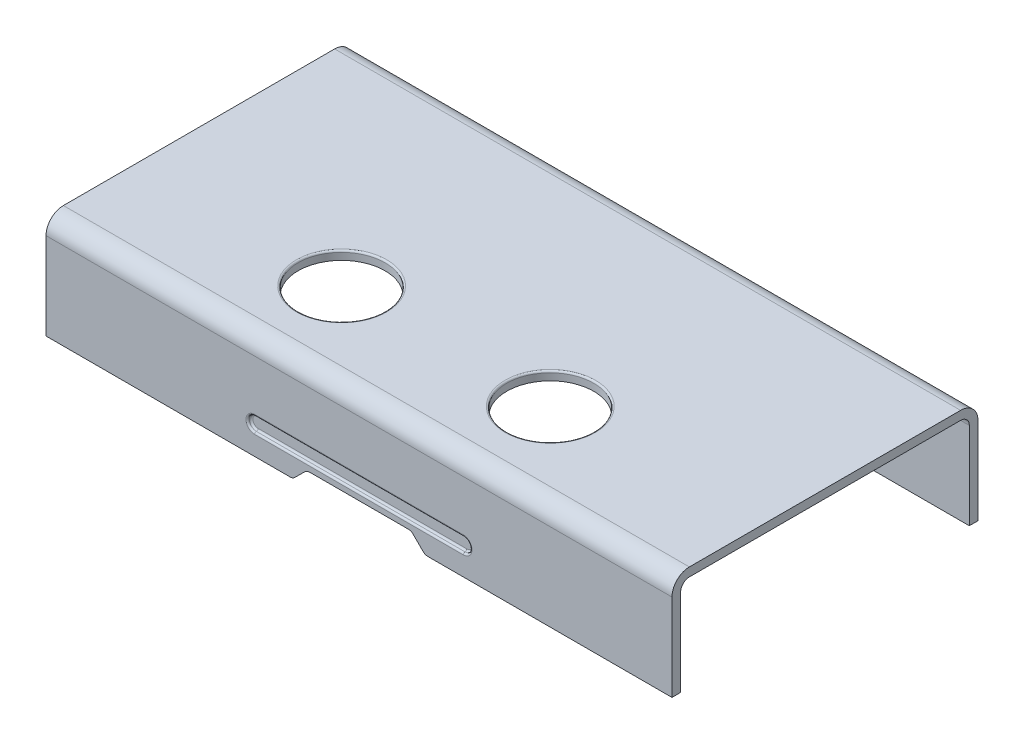
ISO-10303-21;
HEADER;
FILE_DESCRIPTION(('STEP AP214'),'2;1');
FILE_NAME('part.step','',(''),(''),'','','');
FILE_SCHEMA(('AUTOMOTIVE_DESIGN { 1 0 10303 214 1 1 1 1 }'));
ENDSEC;
DATA;
#1=APPLICATION_CONTEXT('core data for automotive mechanical design processes');
#2=APPLICATION_PROTOCOL_DEFINITION('international standard','automotive_design',2000,#1);
#3=PRODUCT_CONTEXT('',#1,'mechanical');
#4=PRODUCT('Part','Part','',(#3));
#5=PRODUCT_RELATED_PRODUCT_CATEGORY('part','',(#4));
#6=PRODUCT_DEFINITION_FORMATION('','',#4);
#7=PRODUCT_DEFINITION_CONTEXT('part definition',#1,'design');
#8=PRODUCT_DEFINITION('design','',#6,#7);
#9=PRODUCT_DEFINITION_SHAPE('','',#8);
#10=(LENGTH_UNIT() NAMED_UNIT(*) SI_UNIT(.MILLI.,.METRE.));
#11=(NAMED_UNIT(*) PLANE_ANGLE_UNIT() SI_UNIT($,.RADIAN.));
#12=(NAMED_UNIT(*) SI_UNIT($,.STERADIAN.) SOLID_ANGLE_UNIT());
#13=UNCERTAINTY_MEASURE_WITH_UNIT(LENGTH_MEASURE(1.E-05),#10,'distance_accuracy_value','');
#14=(GEOMETRIC_REPRESENTATION_CONTEXT(3) GLOBAL_UNCERTAINTY_ASSIGNED_CONTEXT((#13)) GLOBAL_UNIT_ASSIGNED_CONTEXT((#10,
#11,#12)) REPRESENTATION_CONTEXT('',''));
#15=CARTESIAN_POINT('',(0.,0.,0.));
#16=DIRECTION('',(0.,0.,1.));
#17=DIRECTION('',(1.,0.,0.));
#18=AXIS2_PLACEMENT_3D('',#15,#16,#17);
#19=CARTESIAN_POINT('',(0.,0.,0.));
#20=DIRECTION('',(0.,1.,0.));
#21=DIRECTION('',(0.,0.,1.));
#22=AXIS2_PLACEMENT_3D('',#19,#20,#21);
#23=PLANE('',#22);
#24=DIRECTION('',(1.,0.,0.));
#25=VECTOR('',#24,1.);
#26=CARTESIAN_POINT('',(0.,0.,4.15));
#27=LINE('',#26,#25);
#28=CARTESIAN_POINT('',(-9.,0.,4.15));
#29=VERTEX_POINT('',#28);
#30=CARTESIAN_POINT('',(-1.98284271247461,0.,4.15));
#31=VERTEX_POINT('',#30);
#32=EDGE_CURVE('E229',#29,#31,#27,.T.);
#33=ORIENTED_EDGE('',*,*,#32,.T.);
#34=DIRECTION('',(0.,0.,-1.));
#35=VECTOR('',#34,1.);
#36=CARTESIAN_POINT('',(-1.98284271247461,0.,0.));
#37=LINE('',#36,#35);
#38=CARTESIAN_POINT('',(-1.98284271247461,0.,4.4));
#39=VERTEX_POINT('',#38);
#40=EDGE_CURVE('E409',#31,#39,#37,.F.);
#41=ORIENTED_EDGE('',*,*,#40,.T.);
#42=DIRECTION('',(1.,0.,0.));
#43=VECTOR('',#42,1.);
#44=CARTESIAN_POINT('',(-9.,0.,4.4));
#45=LINE('',#44,#43);
#46=CARTESIAN_POINT('',(-9.,0.,4.4));
#47=VERTEX_POINT('',#46);
#48=EDGE_CURVE('E276',#47,#39,#45,.T.);
#49=ORIENTED_EDGE('',*,*,#48,.F.);
#50=DIRECTION('',(0.,0.,1.));
#51=VECTOR('',#50,1.);
#52=CARTESIAN_POINT('',(-9.,0.,-4.4));
#53=LINE('',#52,#51);
#54=EDGE_CURVE('E264',#29,#47,#53,.T.);
#55=ORIENTED_EDGE('',*,*,#54,.F.);
#56=EDGE_LOOP('',(#33,#41,#49,#55));
#57=FACE_BOUND('',#56,.T.);
#58=ADVANCED_FACE('F33',(#57),#23,.F.);
#59=DIRECTION('',(0.,0.,-1.));
#60=VECTOR('',#59,1.);
#61=CARTESIAN_POINT('',(9.,0.,-4.4));
#62=LINE('',#61,#60);
#63=CARTESIAN_POINT('',(9.,0.,-4.15));
#64=VERTEX_POINT('',#63);
#65=CARTESIAN_POINT('',(9.,0.,-4.4));
#66=VERTEX_POINT('',#65);
#67=EDGE_CURVE('E279',#64,#66,#62,.T.);
#68=ORIENTED_EDGE('',*,*,#67,.F.);
#69=DIRECTION('',(-1.,0.,0.));
#70=VECTOR('',#69,1.);
#71=CARTESIAN_POINT('',(0.,0.,-4.15));
#72=LINE('',#71,#70);
#73=CARTESIAN_POINT('',(-9.,0.,-4.15));
#74=VERTEX_POINT('',#73);
#75=EDGE_CURVE('E317',#64,#74,#72,.T.);
#76=ORIENTED_EDGE('',*,*,#75,.T.);
#77=CARTESIAN_POINT('',(-9.,0.,-4.4));
#78=VERTEX_POINT('',#77);
#79=EDGE_CURVE('E273',#78,#74,#53,.T.);
#80=ORIENTED_EDGE('',*,*,#79,.F.);
#81=DIRECTION('',(-1.,0.,0.));
#82=VECTOR('',#81,1.);
#83=CARTESIAN_POINT('',(-9.,0.,-4.4));
#84=LINE('',#83,#82);
#85=EDGE_CURVE('E269',#66,#78,#84,.T.);
#86=ORIENTED_EDGE('',*,*,#85,.F.);
#87=EDGE_LOOP('',(#68,#76,#80,#86));
#88=FACE_BOUND('',#87,.T.);
#89=ADVANCED_FACE('F508',(#88),#23,.F.);
#90=CARTESIAN_POINT('',(-9.,3.,-4.4));
#91=DIRECTION('',(1.,0.,0.));
#92=DIRECTION('',(0.,0.,-1.));
#93=AXIS2_PLACEMENT_3D('',#90,#91,#92);
#94=PLANE('',#93);
#95=ORIENTED_EDGE('',*,*,#79,.T.);
#96=DIRECTION('',(0.,-1.,0.));
#97=VECTOR('',#96,1.);
#98=CARTESIAN_POINT('',(-9.,0.25,-4.15));
#99=LINE('',#98,#97);
#100=CARTESIAN_POINT('',(-9.,2.5,-4.15));
#101=VERTEX_POINT('',#100);
#102=EDGE_CURVE('E222',#101,#74,#99,.T.);
#103=ORIENTED_EDGE('',*,*,#102,.F.);
#104=CARTESIAN_POINT('',(-9.,2.5,-3.9));
#105=DIRECTION('',(-1.,0.,0.));
#106=DIRECTION('',(0.,0.,1.));
#107=AXIS2_PLACEMENT_3D('',#104,#105,#106);
#108=CIRCLE('',#107,0.25);
#109=CARTESIAN_POINT('',(-9.,2.75,-3.9));
#110=VERTEX_POINT('',#109);
#111=EDGE_CURVE('E240',#110,#101,#108,.T.);
#112=ORIENTED_EDGE('',*,*,#111,.F.);
#113=DIRECTION('',(0.,0.,-1.));
#114=VECTOR('',#113,1.);
#115=CARTESIAN_POINT('',(-9.,2.75,3.9));
#116=LINE('',#115,#114);
#117=CARTESIAN_POINT('',(-9.,2.75,3.9));
#118=VERTEX_POINT('',#117);
#119=EDGE_CURVE('E238',#118,#110,#116,.T.);
#120=ORIENTED_EDGE('',*,*,#119,.F.);
#121=CARTESIAN_POINT('',(-9.,2.5,3.9));
#122=DIRECTION('',(-1.,0.,0.));
#123=DIRECTION('',(0.,0.,1.));
#124=AXIS2_PLACEMENT_3D('',#121,#122,#123);
#125=CIRCLE('',#124,0.25);
#126=CARTESIAN_POINT('',(-9.,2.5,4.15));
#127=VERTEX_POINT('',#126);
#128=EDGE_CURVE('E214',#127,#118,#125,.T.);
#129=ORIENTED_EDGE('',*,*,#128,.F.);
#130=DIRECTION('',(0.,1.,0.));
#131=VECTOR('',#130,1.);
#132=CARTESIAN_POINT('',(-9.,0.25,4.15));
#133=LINE('',#132,#131);
#134=EDGE_CURVE('E225',#29,#127,#133,.T.);
#135=ORIENTED_EDGE('',*,*,#134,.F.);
#136=ORIENTED_EDGE('',*,*,#54,.T.);
#137=DIRECTION('',(0.,-1.,0.));
#138=VECTOR('',#137,1.);
#139=CARTESIAN_POINT('',(-9.,3.,4.4));
#140=LINE('',#139,#138);
#141=CARTESIAN_POINT('',(-9.,2.5,4.4));
#142=VERTEX_POINT('',#141);
#143=EDGE_CURVE('E292',#142,#47,#140,.T.);
#144=ORIENTED_EDGE('',*,*,#143,.F.);
#145=CARTESIAN_POINT('',(-9.,2.5,3.9));
#146=DIRECTION('',(1.,0.,0.));
#147=DIRECTION('',(0.,0.,-1.));
#148=AXIS2_PLACEMENT_3D('',#145,#146,#147);
#149=CIRCLE('',#148,0.5);
#150=CARTESIAN_POINT('',(-9.,3.,3.9));
#151=VERTEX_POINT('',#150);
#152=EDGE_CURVE('E309',#142,#151,#149,.F.);
#153=ORIENTED_EDGE('',*,*,#152,.T.);
#154=DIRECTION('',(0.,0.,1.));
#155=VECTOR('',#154,1.);
#156=CARTESIAN_POINT('',(-9.,3.,-4.4));
#157=LINE('',#156,#155);
#158=CARTESIAN_POINT('',(-9.,3.,-3.9));
#159=VERTEX_POINT('',#158);
#160=EDGE_CURVE('E265',#159,#151,#157,.T.);
#161=ORIENTED_EDGE('',*,*,#160,.F.);
#162=CARTESIAN_POINT('',(-9.,2.5,-3.9));
#163=DIRECTION('',(1.,0.,0.));
#164=DIRECTION('',(0.,0.,-1.));
#165=AXIS2_PLACEMENT_3D('',#162,#163,#164);
#166=CIRCLE('',#165,0.5);
#167=CARTESIAN_POINT('',(-9.,2.5,-4.4));
#168=VERTEX_POINT('',#167);
#169=EDGE_CURVE('E307',#159,#168,#166,.F.);
#170=ORIENTED_EDGE('',*,*,#169,.T.);
#171=DIRECTION('',(0.,-1.,0.));
#172=VECTOR('',#171,1.);
#173=CARTESIAN_POINT('',(-9.,3.,-4.4));
#174=LINE('',#173,#172);
#175=EDGE_CURVE('E272',#168,#78,#174,.T.);
#176=ORIENTED_EDGE('',*,*,#175,.T.);
#177=EDGE_LOOP('',(#95,#103,#112,#120,#129,#135,#136,#144,#153,#161,#170,#176));
#178=FACE_BOUND('',#177,.T.);
#179=ADVANCED_FACE('F235',(#178),#94,.F.);
#180=CARTESIAN_POINT('',(-9.,3.,4.4));
#181=DIRECTION('',(0.,0.,-1.));
#182=DIRECTION('',(-1.,0.,0.));
#183=AXIS2_PLACEMENT_3D('',#180,#181,#182);
#184=PLANE('',#183);
#185=DIRECTION('',(-1.,0.,0.));
#186=VECTOR('',#185,1.);
#187=CARTESIAN_POINT('',(-9.,1.05,4.4));
#188=LINE('',#187,#186);
#189=CARTESIAN_POINT('',(-3.,1.05,4.4));
#190=VERTEX_POINT('',#189);
#191=CARTESIAN_POINT('',(3.,1.05,4.4));
#192=VERTEX_POINT('',#191);
#193=EDGE_CURVE('E338',#190,#192,#188,.F.);
#194=ORIENTED_EDGE('',*,*,#193,.T.);
#195=CARTESIAN_POINT('',(3.,0.8,4.4));
#196=DIRECTION('',(0.,0.,-1.));
#197=DIRECTION('',(-1.,0.,0.));
#198=AXIS2_PLACEMENT_3D('',#195,#196,#197);
#199=CIRCLE('',#198,0.25);
#200=CARTESIAN_POINT('',(3.,0.55,4.4));
#201=VERTEX_POINT('',#200);
#202=EDGE_CURVE('E344',#192,#201,#199,.T.);
#203=ORIENTED_EDGE('',*,*,#202,.T.);
#204=DIRECTION('',(1.,0.,0.));
#205=VECTOR('',#204,1.);
#206=CARTESIAN_POINT('',(-9.,0.55,4.4));
#207=LINE('',#206,#205);
#208=CARTESIAN_POINT('',(-3.,0.55,4.4));
#209=VERTEX_POINT('',#208);
#210=EDGE_CURVE('E342',#201,#209,#207,.F.);
#211=ORIENTED_EDGE('',*,*,#210,.T.);
#212=CARTESIAN_POINT('',(-3.,0.8,4.4));
#213=DIRECTION('',(0.,0.,-1.));
#214=DIRECTION('',(-1.,0.,0.));
#215=AXIS2_PLACEMENT_3D('',#212,#213,#214);
#216=CIRCLE('',#215,0.25);
#217=EDGE_CURVE('E340',#209,#190,#216,.T.);
#218=ORIENTED_EDGE('',*,*,#217,.T.);
#219=EDGE_LOOP('',(#194,#203,#211,#218));
#220=FACE_BOUND('',#219,.T.);
#221=DIRECTION('',(-0.707106781186551,0.707106781186544,0.));
#222=VECTOR('',#221,1.);
#223=CARTESIAN_POINT('',(-5.05000000000006,6.94999999999998,4.4));
#224=LINE('',#223,#222);
#225=CARTESIAN_POINT('',(1.55857864376268,0.34142135623731,4.4));
#226=VERTEX_POINT('',#225);
#227=CARTESIAN_POINT('',(1.84142135623731,0.0585786437626891,4.4));
#228=VERTEX_POINT('',#227);
#229=EDGE_CURVE('E327',#226,#228,#224,.F.);
#230=ORIENTED_EDGE('',*,*,#229,.T.);
#231=CARTESIAN_POINT('',(1.98284271247461,0.2,4.4));
#232=DIRECTION('',(0.,0.,-1.));
#233=DIRECTION('',(-1.,0.,0.));
#234=AXIS2_PLACEMENT_3D('',#231,#232,#233);
#235=CIRCLE('',#234,0.2);
#236=CARTESIAN_POINT('',(1.98284271247461,0.,4.4));
#237=VERTEX_POINT('',#236);
#238=EDGE_CURVE('E402',#228,#237,#235,.F.);
#239=ORIENTED_EDGE('',*,*,#238,.T.);
#240=CARTESIAN_POINT('',(9.,0.,4.4));
#241=VERTEX_POINT('',#240);
#242=EDGE_CURVE('E275',#237,#241,#45,.T.);
#243=ORIENTED_EDGE('',*,*,#242,.T.);
#244=DIRECTION('',(0.,-1.,0.));
#245=VECTOR('',#244,1.);
#246=CARTESIAN_POINT('',(9.,3.,4.4));
#247=LINE('',#246,#245);
#248=CARTESIAN_POINT('',(9.,2.5,4.4));
#249=VERTEX_POINT('',#248);
#250=EDGE_CURVE('E289',#249,#241,#247,.T.);
#251=ORIENTED_EDGE('',*,*,#250,.F.);
#252=DIRECTION('',(1.,0.,0.));
#253=VECTOR('',#252,1.);
#254=CARTESIAN_POINT('',(-9.,2.5,4.4));
#255=LINE('',#254,#253);
#256=EDGE_CURVE('E305',#249,#142,#255,.F.);
#257=ORIENTED_EDGE('',*,*,#256,.T.);
#258=ORIENTED_EDGE('',*,*,#143,.T.);
#259=ORIENTED_EDGE('',*,*,#48,.T.);
#260=CARTESIAN_POINT('',(-1.98284271247461,0.2,4.4));
#261=DIRECTION('',(0.,0.,-1.));
#262=DIRECTION('',(-1.,0.,0.));
#263=AXIS2_PLACEMENT_3D('',#260,#261,#262);
#264=CIRCLE('',#263,0.2);
#265=CARTESIAN_POINT('',(-1.8414213562373,0.0585786437626917,4.4));
#266=VERTEX_POINT('',#265);
#267=EDGE_CURVE('E400',#39,#266,#264,.F.);
#268=ORIENTED_EDGE('',*,*,#267,.T.);
#269=DIRECTION('',(-0.707106781186544,-0.707106781186551,0.));
#270=VECTOR('',#269,1.);
#271=CARTESIAN_POINT('',(-3.94999999999996,-2.04999999999999,4.4));
#272=LINE('',#271,#270);
#273=CARTESIAN_POINT('',(-1.55857864376269,0.341421356237309,4.4));
#274=VERTEX_POINT('',#273);
#275=EDGE_CURVE('E333',#266,#274,#272,.F.);
#276=ORIENTED_EDGE('',*,*,#275,.T.);
#277=CARTESIAN_POINT('',(-1.41715728752538,0.2,4.4));
#278=DIRECTION('',(0.,0.,-1.));
#279=DIRECTION('',(-1.,0.,0.));
#280=AXIS2_PLACEMENT_3D('',#277,#278,#279);
#281=CIRCLE('',#280,0.2);
#282=CARTESIAN_POINT('',(-1.41715728752538,0.4,4.4));
#283=VERTEX_POINT('',#282);
#284=EDGE_CURVE('E48',#274,#283,#281,.T.);
#285=ORIENTED_EDGE('',*,*,#284,.T.);
#286=DIRECTION('',(-1.,0.,0.));
#287=VECTOR('',#286,1.);
#288=CARTESIAN_POINT('',(-2.,0.4,4.4));
#289=LINE('',#288,#287);
#290=CARTESIAN_POINT('',(1.41715728752537,0.4,4.4));
#291=VERTEX_POINT('',#290);
#292=EDGE_CURVE('E232',#291,#283,#289,.T.);
#293=ORIENTED_EDGE('',*,*,#292,.F.);
#294=CARTESIAN_POINT('',(1.41715728752537,0.2,4.4));
#295=DIRECTION('',(0.,0.,-1.));
#296=DIRECTION('',(-1.,0.,0.));
#297=AXIS2_PLACEMENT_3D('',#294,#295,#296);
#298=CIRCLE('',#297,0.2);
#299=EDGE_CURVE('E56',#291,#226,#298,.T.);
#300=ORIENTED_EDGE('',*,*,#299,.T.);
#301=EDGE_LOOP('',(#230,#239,#243,#251,#257,#258,#259,#268,#276,#285,#293,#300));
#302=FACE_BOUND('',#301,.T.);
#303=ADVANCED_FACE('F469',(#220,#302),#184,.F.);
#304=CARTESIAN_POINT('',(9.,3.,-4.4));
#305=DIRECTION('',(-1.,0.,0.));
#306=DIRECTION('',(0.,0.,1.));
#307=AXIS2_PLACEMENT_3D('',#304,#305,#306);
#308=PLANE('',#307);
#309=CARTESIAN_POINT('',(9.,2.5,-3.9));
#310=DIRECTION('',(-1.,0.,0.));
#311=DIRECTION('',(0.,0.,1.));
#312=AXIS2_PLACEMENT_3D('',#309,#310,#311);
#313=CIRCLE('',#312,0.25);
#314=CARTESIAN_POINT('',(9.,2.75,-3.9));
#315=VERTEX_POINT('',#314);
#316=CARTESIAN_POINT('',(9.,2.5,-4.15));
#317=VERTEX_POINT('',#316);
#318=EDGE_CURVE('E321',#315,#317,#313,.T.);
#319=ORIENTED_EDGE('',*,*,#318,.T.);
#320=DIRECTION('',(0.,-1.,0.));
#321=VECTOR('',#320,1.);
#322=CARTESIAN_POINT('',(9.,3.,-4.15));
#323=LINE('',#322,#321);
#324=EDGE_CURVE('E261',#317,#64,#323,.T.);
#325=ORIENTED_EDGE('',*,*,#324,.T.);
#326=ORIENTED_EDGE('',*,*,#67,.T.);
#327=DIRECTION('',(0.,-1.,0.));
#328=VECTOR('',#327,1.);
#329=CARTESIAN_POINT('',(9.,3.,-4.4));
#330=LINE('',#329,#328);
#331=CARTESIAN_POINT('',(9.,2.5,-4.4));
#332=VERTEX_POINT('',#331);
#333=EDGE_CURVE('E286',#332,#66,#330,.T.);
#334=ORIENTED_EDGE('',*,*,#333,.F.);
#335=CARTESIAN_POINT('',(9.,2.5,-3.9));
#336=DIRECTION('',(-1.,0.,0.));
#337=DIRECTION('',(0.,0.,1.));
#338=AXIS2_PLACEMENT_3D('',#335,#336,#337);
#339=CIRCLE('',#338,0.5);
#340=CARTESIAN_POINT('',(9.,3.,-3.9));
#341=VERTEX_POINT('',#340);
#342=EDGE_CURVE('E301',#332,#341,#339,.F.);
#343=ORIENTED_EDGE('',*,*,#342,.T.);
#344=DIRECTION('',(0.,0.,-1.));
#345=VECTOR('',#344,1.);
#346=CARTESIAN_POINT('',(9.,3.,-4.4));
#347=LINE('',#346,#345);
#348=CARTESIAN_POINT('',(9.,3.,3.9));
#349=VERTEX_POINT('',#348);
#350=EDGE_CURVE('E268',#349,#341,#347,.T.);
#351=ORIENTED_EDGE('',*,*,#350,.F.);
#352=CARTESIAN_POINT('',(9.,2.5,3.9));
#353=DIRECTION('',(-1.,0.,0.));
#354=DIRECTION('',(0.,0.,1.));
#355=AXIS2_PLACEMENT_3D('',#352,#353,#354);
#356=CIRCLE('',#355,0.5);
#357=EDGE_CURVE('E303',#349,#249,#356,.F.);
#358=ORIENTED_EDGE('',*,*,#357,.T.);
#359=ORIENTED_EDGE('',*,*,#250,.T.);
#360=CARTESIAN_POINT('',(9.,0.,4.15));
#361=VERTEX_POINT('',#360);
#362=EDGE_CURVE('E280',#241,#361,#62,.T.);
#363=ORIENTED_EDGE('',*,*,#362,.T.);
#364=DIRECTION('',(0.,1.,0.));
#365=VECTOR('',#364,1.);
#366=CARTESIAN_POINT('',(9.,3.,4.15));
#367=LINE('',#366,#365);
#368=CARTESIAN_POINT('',(9.,2.5,4.15));
#369=VERTEX_POINT('',#368);
#370=EDGE_CURVE('E259',#361,#369,#367,.T.);
#371=ORIENTED_EDGE('',*,*,#370,.T.);
#372=CARTESIAN_POINT('',(9.,2.5,3.9));
#373=DIRECTION('',(-1.,0.,0.));
#374=DIRECTION('',(0.,0.,1.));
#375=AXIS2_PLACEMENT_3D('',#372,#373,#374);
#376=CIRCLE('',#375,0.25);
#377=CARTESIAN_POINT('',(9.,2.75,3.9));
#378=VERTEX_POINT('',#377);
#379=EDGE_CURVE('E217',#369,#378,#376,.T.);
#380=ORIENTED_EDGE('',*,*,#379,.T.);
#381=DIRECTION('',(0.,0.,-1.));
#382=VECTOR('',#381,1.);
#383=CARTESIAN_POINT('',(9.,2.75,-4.4));
#384=LINE('',#383,#382);
#385=EDGE_CURVE('E256',#378,#315,#384,.T.);
#386=ORIENTED_EDGE('',*,*,#385,.T.);
#387=EDGE_LOOP('',(#319,#325,#326,#334,#343,#351,#358,#359,#363,#371,#380,#386));
#388=FACE_BOUND('',#387,.T.);
#389=ADVANCED_FACE('F455',(#388),#308,.F.);
#390=CARTESIAN_POINT('',(-9.,3.,-4.4));
#391=DIRECTION('',(0.,0.,1.));
#392=DIRECTION('',(1.,0.,0.));
#393=AXIS2_PLACEMENT_3D('',#390,#391,#392);
#394=PLANE('',#393);
#395=ORIENTED_EDGE('',*,*,#175,.F.);
#396=DIRECTION('',(-1.,0.,0.));
#397=VECTOR('',#396,1.);
#398=CARTESIAN_POINT('',(9.,2.5,-4.4));
#399=LINE('',#398,#397);
#400=EDGE_CURVE('E311',#168,#332,#399,.F.);
#401=ORIENTED_EDGE('',*,*,#400,.T.);
#402=ORIENTED_EDGE('',*,*,#333,.T.);
#403=ORIENTED_EDGE('',*,*,#85,.T.);
#404=EDGE_LOOP('',(#395,#401,#402,#403));
#405=FACE_BOUND('',#404,.T.);
#406=ADVANCED_FACE('F502',(#405),#394,.F.);
#407=CARTESIAN_POINT('',(0.,3.,0.));
#408=DIRECTION('',(0.,1.,0.));
#409=DIRECTION('',(0.,0.,1.));
#410=AXIS2_PLACEMENT_3D('',#407,#408,#409);
#411=PLANE('',#410);
#412=CARTESIAN_POINT('',(3.,3.,1.9));
#413=DIRECTION('',(0.,1.,0.));
#414=DIRECTION('',(0.,0.,1.));
#415=AXIS2_PLACEMENT_3D('',#412,#413,#414);
#416=CIRCLE('',#415,1.3);
#417=CARTESIAN_POINT('',(3.,3.,3.2));
#418=VERTEX_POINT('',#417);
#419=EDGE_CURVE('E41',#418,#418,#416,.F.);
#420=ORIENTED_EDGE('',*,*,#419,.T.);
#421=EDGE_LOOP('',(#420));
#422=FACE_BOUND('',#421,.T.);
#423=CARTESIAN_POINT('',(-3.,3.,1.9));
#424=DIRECTION('',(0.,1.,0.));
#425=DIRECTION('',(0.,0.,1.));
#426=AXIS2_PLACEMENT_3D('',#423,#424,#425);
#427=CIRCLE('',#426,1.3);
#428=CARTESIAN_POINT('',(-3.,3.,3.2));
#429=VERTEX_POINT('',#428);
#430=EDGE_CURVE('E425',#429,#429,#427,.F.);
#431=ORIENTED_EDGE('',*,*,#430,.T.);
#432=EDGE_LOOP('',(#431));
#433=FACE_BOUND('',#432,.T.);
#434=ORIENTED_EDGE('',*,*,#160,.T.);
#435=DIRECTION('',(1.,0.,0.));
#436=VECTOR('',#435,1.);
#437=CARTESIAN_POINT('',(9.,3.,3.9));
#438=LINE('',#437,#436);
#439=EDGE_CURVE('E298',#151,#349,#438,.T.);
#440=ORIENTED_EDGE('',*,*,#439,.T.);
#441=ORIENTED_EDGE('',*,*,#350,.T.);
#442=DIRECTION('',(-1.,0.,0.));
#443=VECTOR('',#442,1.);
#444=CARTESIAN_POINT('',(-9.,3.,-3.9));
#445=LINE('',#444,#443);
#446=EDGE_CURVE('E295',#341,#159,#445,.T.);
#447=ORIENTED_EDGE('',*,*,#446,.T.);
#448=EDGE_LOOP('',(#434,#440,#441,#447));
#449=FACE_BOUND('',#448,.T.);
#450=ADVANCED_FACE('F430',(#422,#433,#449),#411,.T.);
#451=ORIENTED_EDGE('',*,*,#242,.F.);
#452=DIRECTION('',(0.,0.,1.));
#453=VECTOR('',#452,1.);
#454=CARTESIAN_POINT('',(1.98284271247461,0.,0.));
#455=LINE('',#454,#453);
#456=CARTESIAN_POINT('',(1.98284271247461,0.,4.15));
#457=VERTEX_POINT('',#456);
#458=EDGE_CURVE('E356',#237,#457,#455,.F.);
#459=ORIENTED_EDGE('',*,*,#458,.T.);
#460=EDGE_CURVE('E313',#457,#361,#27,.T.);
#461=ORIENTED_EDGE('',*,*,#460,.T.);
#462=ORIENTED_EDGE('',*,*,#362,.F.);
#463=EDGE_LOOP('',(#451,#459,#461,#462));
#464=FACE_BOUND('',#463,.T.);
#465=ADVANCED_FACE('F460',(#464),#23,.F.);
#466=CARTESIAN_POINT('',(-3.,0.,1.9));
#467=DIRECTION('',(0.,1.,0.));
#468=DIRECTION('',(0.,0.,1.));
#469=AXIS2_PLACEMENT_3D('',#466,#467,#468);
#470=CYLINDRICAL_SURFACE('',#469,1.25);
#471=CARTESIAN_POINT('',(-3.,2.95,1.9));
#472=DIRECTION('',(0.,1.,0.));
#473=DIRECTION('',(0.,0.,1.));
#474=AXIS2_PLACEMENT_3D('',#471,#472,#473);
#475=CIRCLE('',#474,1.25);
#476=CARTESIAN_POINT('',(-3.,2.95,3.15));
#477=VERTEX_POINT('',#476);
#478=EDGE_CURVE('E11',#477,#477,#475,.T.);
#479=ORIENTED_EDGE('',*,*,#478,.T.);
#480=EDGE_LOOP('',(#479));
#481=FACE_BOUND('',#480,.T.);
#482=CARTESIAN_POINT('',(-3.,2.75,1.9));
#483=DIRECTION('',(0.,1.,0.));
#484=DIRECTION('',(0.,0.,1.));
#485=AXIS2_PLACEMENT_3D('',#482,#483,#484);
#486=CIRCLE('',#485,1.25);
#487=CARTESIAN_POINT('',(-3.,2.75,3.15));
#488=VERTEX_POINT('',#487);
#489=EDGE_CURVE('E253',#488,#488,#486,.F.);
#490=ORIENTED_EDGE('',*,*,#489,.T.);
#491=EDGE_LOOP('',(#490));
#492=FACE_BOUND('',#491,.T.);
#493=ADVANCED_FACE('F443',(#481,#492),#470,.F.);
#494=CARTESIAN_POINT('',(3.,0.,1.9));
#495=DIRECTION('',(0.,1.,0.));
#496=DIRECTION('',(0.,0.,1.));
#497=AXIS2_PLACEMENT_3D('',#494,#495,#496);
#498=CYLINDRICAL_SURFACE('',#497,1.25);
#499=CARTESIAN_POINT('',(3.,2.95,1.9));
#500=DIRECTION('',(0.,1.,0.));
#501=DIRECTION('',(0.,0.,1.));
#502=AXIS2_PLACEMENT_3D('',#499,#500,#501);
#503=CIRCLE('',#502,1.25);
#504=CARTESIAN_POINT('',(3.,2.95,3.15));
#505=VERTEX_POINT('',#504);
#506=EDGE_CURVE('E422',#505,#505,#503,.T.);
#507=ORIENTED_EDGE('',*,*,#506,.T.);
#508=EDGE_LOOP('',(#507));
#509=FACE_BOUND('',#508,.T.);
#510=CARTESIAN_POINT('',(3.,2.75,1.9));
#511=DIRECTION('',(0.,1.,0.));
#512=DIRECTION('',(0.,0.,1.));
#513=AXIS2_PLACEMENT_3D('',#510,#511,#512);
#514=CIRCLE('',#513,1.25);
#515=CARTESIAN_POINT('',(3.,2.75,3.15));
#516=VERTEX_POINT('',#515);
#517=EDGE_CURVE('E249',#516,#516,#514,.F.);
#518=ORIENTED_EDGE('',*,*,#517,.T.);
#519=EDGE_LOOP('',(#518));
#520=FACE_BOUND('',#519,.T.);
#521=ADVANCED_FACE('F439',(#509,#520),#498,.F.);
#522=CARTESIAN_POINT('',(0.,2.5,3.9));
#523=DIRECTION('',(-1.,0.,0.));
#524=DIRECTION('',(0.,0.,1.));
#525=AXIS2_PLACEMENT_3D('',#522,#523,#524);
#526=CYLINDRICAL_SURFACE('',#525,0.5);
#527=ORIENTED_EDGE('',*,*,#152,.F.);
#528=ORIENTED_EDGE('',*,*,#256,.F.);
#529=ORIENTED_EDGE('',*,*,#357,.F.);
#530=ORIENTED_EDGE('',*,*,#439,.F.);
#531=EDGE_LOOP('',(#527,#528,#529,#530));
#532=FACE_BOUND('',#531,.T.);
#533=ADVANCED_FACE('F442',(#532),#526,.T.);
#534=CARTESIAN_POINT('',(0.,2.5,-3.9));
#535=DIRECTION('',(1.,0.,0.));
#536=DIRECTION('',(0.,0.,-1.));
#537=AXIS2_PLACEMENT_3D('',#534,#535,#536);
#538=CYLINDRICAL_SURFACE('',#537,0.5);
#539=ORIENTED_EDGE('',*,*,#342,.F.);
#540=ORIENTED_EDGE('',*,*,#400,.F.);
#541=ORIENTED_EDGE('',*,*,#169,.F.);
#542=ORIENTED_EDGE('',*,*,#446,.F.);
#543=EDGE_LOOP('',(#539,#540,#541,#542));
#544=FACE_BOUND('',#543,.T.);
#545=ADVANCED_FACE('F498',(#544),#538,.T.);
#546=CARTESIAN_POINT('',(14.,2.5,-3.9));
#547=DIRECTION('',(-1.,0.,0.));
#548=DIRECTION('',(0.,0.,1.));
#549=AXIS2_PLACEMENT_3D('',#546,#547,#548);
#550=CYLINDRICAL_SURFACE('',#549,0.25);
#551=DIRECTION('',(-1.,0.,0.));
#552=VECTOR('',#551,1.);
#553=CARTESIAN_POINT('',(14.,2.75,-3.9));
#554=LINE('',#553,#552);
#555=EDGE_CURVE('E250',#315,#110,#554,.T.);
#556=ORIENTED_EDGE('',*,*,#555,.T.);
#557=ORIENTED_EDGE('',*,*,#111,.T.);
#558=DIRECTION('',(-1.,0.,0.));
#559=VECTOR('',#558,1.);
#560=CARTESIAN_POINT('',(14.,2.5,-4.15));
#561=LINE('',#560,#559);
#562=EDGE_CURVE('E247',#317,#101,#561,.T.);
#563=ORIENTED_EDGE('',*,*,#562,.F.);
#564=ORIENTED_EDGE('',*,*,#318,.F.);
#565=EDGE_LOOP('',(#556,#557,#563,#564));
#566=FACE_BOUND('',#565,.T.);
#567=ADVANCED_FACE('F514',(#566),#550,.F.);
#568=CARTESIAN_POINT('',(14.,2.5,3.9));
#569=DIRECTION('',(-1.,0.,0.));
#570=DIRECTION('',(0.,0.,1.));
#571=AXIS2_PLACEMENT_3D('',#568,#569,#570);
#572=CYLINDRICAL_SURFACE('',#571,0.25);
#573=DIRECTION('',(-1.,0.,0.));
#574=VECTOR('',#573,1.);
#575=CARTESIAN_POINT('',(14.,2.5,4.15));
#576=LINE('',#575,#574);
#577=EDGE_CURVE('E209',#369,#127,#576,.T.);
#578=ORIENTED_EDGE('',*,*,#577,.T.);
#579=ORIENTED_EDGE('',*,*,#128,.T.);
#580=DIRECTION('',(-1.,0.,0.));
#581=VECTOR('',#580,1.);
#582=CARTESIAN_POINT('',(14.,2.75,3.9));
#583=LINE('',#582,#581);
#584=EDGE_CURVE('E221',#378,#118,#583,.T.);
#585=ORIENTED_EDGE('',*,*,#584,.F.);
#586=ORIENTED_EDGE('',*,*,#379,.F.);
#587=EDGE_LOOP('',(#578,#579,#585,#586));
#588=FACE_BOUND('',#587,.T.);
#589=ADVANCED_FACE('F211',(#588),#572,.F.);
#590=CARTESIAN_POINT('',(14.,0.25,-4.15));
#591=DIRECTION('',(0.,0.,-1.));
#592=DIRECTION('',(-1.,0.,0.));
#593=AXIS2_PLACEMENT_3D('',#590,#591,#592);
#594=PLANE('',#593);
#595=ORIENTED_EDGE('',*,*,#562,.T.);
#596=ORIENTED_EDGE('',*,*,#102,.T.);
#597=ORIENTED_EDGE('',*,*,#75,.F.);
#598=ORIENTED_EDGE('',*,*,#324,.F.);
#599=EDGE_LOOP('',(#595,#596,#597,#598));
#600=FACE_BOUND('',#599,.T.);
#601=ADVANCED_FACE('F511',(#600),#594,.F.);
#602=CARTESIAN_POINT('',(14.,0.25,4.15));
#603=DIRECTION('',(0.,0.,1.));
#604=DIRECTION('',(1.,0.,0.));
#605=AXIS2_PLACEMENT_3D('',#602,#603,#604);
#606=PLANE('',#605);
#607=ORIENTED_EDGE('',*,*,#460,.F.);
#608=CARTESIAN_POINT('',(1.98284271247461,0.2,4.15));
#609=DIRECTION('',(0.,0.,1.));
#610=DIRECTION('',(1.,0.,0.));
#611=AXIS2_PLACEMENT_3D('',#608,#609,#610);
#612=CIRCLE('',#611,0.2);
#613=CARTESIAN_POINT('',(1.8414213562373,0.0585786437626908,4.15));
#614=VERTEX_POINT('',#613);
#615=EDGE_CURVE('E394',#457,#614,#612,.F.);
#616=ORIENTED_EDGE('',*,*,#615,.T.);
#617=DIRECTION('',(0.707106781186551,-0.707106781186544,0.));
#618=VECTOR('',#617,1.);
#619=CARTESIAN_POINT('',(7.82500000000006,-5.925,4.15));
#620=LINE('',#619,#618);
#621=CARTESIAN_POINT('',(1.55857864376268,0.34142135623731,4.15));
#622=VERTEX_POINT('',#621);
#623=EDGE_CURVE('E330',#614,#622,#620,.F.);
#624=ORIENTED_EDGE('',*,*,#623,.T.);
#625=CARTESIAN_POINT('',(1.41715728752537,0.2,4.15));
#626=DIRECTION('',(0.,0.,1.));
#627=DIRECTION('',(1.,0.,0.));
#628=AXIS2_PLACEMENT_3D('',#625,#626,#627);
#629=CIRCLE('',#628,0.2);
#630=CARTESIAN_POINT('',(1.41715728752537,0.4,4.15));
#631=VERTEX_POINT('',#630);
#632=EDGE_CURVE('E417',#622,#631,#629,.T.);
#633=ORIENTED_EDGE('',*,*,#632,.T.);
#634=DIRECTION('',(-1.,0.,0.));
#635=VECTOR('',#634,1.);
#636=CARTESIAN_POINT('',(14.,0.4,4.15));
#637=LINE('',#636,#635);
#638=CARTESIAN_POINT('',(-1.41715728752538,0.4,4.15));
#639=VERTEX_POINT('',#638);
#640=EDGE_CURVE('E324',#631,#639,#637,.T.);
#641=ORIENTED_EDGE('',*,*,#640,.T.);
#642=CARTESIAN_POINT('',(-1.41715728752538,0.2,4.15));
#643=DIRECTION('',(0.,0.,1.));
#644=DIRECTION('',(1.,0.,0.));
#645=AXIS2_PLACEMENT_3D('',#642,#643,#644);
#646=CIRCLE('',#645,0.2);
#647=CARTESIAN_POINT('',(-1.55857864376269,0.341421356237309,4.15));
#648=VERTEX_POINT('',#647);
#649=EDGE_CURVE('E419',#639,#648,#646,.T.);
#650=ORIENTED_EDGE('',*,*,#649,.T.);
#651=DIRECTION('',(0.707106781186544,0.707106781186551,0.));
#652=VECTOR('',#651,1.);
#653=CARTESIAN_POINT('',(6.17499999999992,8.075,4.15));
#654=LINE('',#653,#652);
#655=CARTESIAN_POINT('',(-1.8414213562373,0.0585786437626908,4.15));
#656=VERTEX_POINT('',#655);
#657=EDGE_CURVE('E335',#648,#656,#654,.F.);
#658=ORIENTED_EDGE('',*,*,#657,.T.);
#659=CARTESIAN_POINT('',(-1.98284271247461,0.2,4.15));
#660=DIRECTION('',(0.,0.,1.));
#661=DIRECTION('',(1.,0.,0.));
#662=AXIS2_PLACEMENT_3D('',#659,#660,#661);
#663=CIRCLE('',#662,0.2);
#664=EDGE_CURVE('E392',#656,#31,#663,.F.);
#665=ORIENTED_EDGE('',*,*,#664,.T.);
#666=ORIENTED_EDGE('',*,*,#32,.F.);
#667=ORIENTED_EDGE('',*,*,#134,.T.);
#668=ORIENTED_EDGE('',*,*,#577,.F.);
#669=ORIENTED_EDGE('',*,*,#370,.F.);
#670=EDGE_LOOP('',(#607,#616,#624,#633,#641,#650,#658,#665,#666,#667,#668,#669));
#671=FACE_BOUND('',#670,.T.);
#672=ADVANCED_FACE('F227',(#671),#606,.F.);
#673=CARTESIAN_POINT('',(14.,2.75,3.9));
#674=DIRECTION('',(0.,1.,0.));
#675=DIRECTION('',(0.,0.,1.));
#676=AXIS2_PLACEMENT_3D('',#673,#674,#675);
#677=PLANE('',#676);
#678=ORIENTED_EDGE('',*,*,#489,.F.);
#679=EDGE_LOOP('',(#678));
#680=FACE_BOUND('',#679,.T.);
#681=ORIENTED_EDGE('',*,*,#517,.F.);
#682=EDGE_LOOP('',(#681));
#683=FACE_BOUND('',#682,.T.);
#684=ORIENTED_EDGE('',*,*,#584,.T.);
#685=ORIENTED_EDGE('',*,*,#119,.T.);
#686=ORIENTED_EDGE('',*,*,#555,.F.);
#687=ORIENTED_EDGE('',*,*,#385,.F.);
#688=EDGE_LOOP('',(#684,#685,#686,#687));
#689=FACE_BOUND('',#688,.T.);
#690=ADVANCED_FACE('F447',(#680,#683,#689),#677,.F.);
#691=CARTESIAN_POINT('',(-2.,0.4,2.4));
#692=DIRECTION('',(0.,1.,0.));
#693=DIRECTION('',(-1.,0.,0.));
#694=AXIS2_PLACEMENT_3D('',#691,#692,#693);
#695=PLANE('',#694);
#696=ORIENTED_EDGE('',*,*,#640,.F.);
#697=DIRECTION('',(0.,0.,-1.));
#698=VECTOR('',#697,1.);
#699=CARTESIAN_POINT('',(1.41715728752537,0.4,4.4));
#700=LINE('',#699,#698);
#701=EDGE_CURVE('E407',#631,#291,#700,.F.);
#702=ORIENTED_EDGE('',*,*,#701,.T.);
#703=ORIENTED_EDGE('',*,*,#292,.T.);
#704=DIRECTION('',(0.,0.,1.));
#705=VECTOR('',#704,1.);
#706=CARTESIAN_POINT('',(-1.41715728752538,0.4,4.15));
#707=LINE('',#706,#705);
#708=EDGE_CURVE('E404',#283,#639,#707,.F.);
#709=ORIENTED_EDGE('',*,*,#708,.T.);
#710=EDGE_LOOP('',(#696,#702,#703,#709));
#711=FACE_BOUND('',#710,.T.);
#712=ADVANCED_FACE('F450',(#711),#695,.F.);
#713=CARTESIAN_POINT('',(1.49999999999999,0.4,2.4));
#714=DIRECTION('',(-0.707106781186544,-0.707106781186551,0.));
#715=DIRECTION('',(0.,0.,-1.));
#716=AXIS2_PLACEMENT_3D('',#713,#714,#715);
#717=PLANE('',#716);
#718=ORIENTED_EDGE('',*,*,#623,.F.);
#719=DIRECTION('',(0.,0.,-1.));
#720=VECTOR('',#719,1.);
#721=CARTESIAN_POINT('',(1.8414213562373,0.0585786437626898,2.4));
#722=LINE('',#721,#720);
#723=EDGE_CURVE('E398',#614,#228,#722,.F.);
#724=ORIENTED_EDGE('',*,*,#723,.T.);
#725=ORIENTED_EDGE('',*,*,#229,.F.);
#726=DIRECTION('',(0.,0.,1.));
#727=VECTOR('',#726,1.);
#728=CARTESIAN_POINT('',(1.55857864376268,0.34142135623731,4.15));
#729=LINE('',#728,#727);
#730=EDGE_CURVE('E396',#226,#622,#729,.F.);
#731=ORIENTED_EDGE('',*,*,#730,.T.);
#732=EDGE_LOOP('',(#718,#724,#725,#731));
#733=FACE_BOUND('',#732,.T.);
#734=ADVANCED_FACE('F468',(#733),#717,.T.);
#735=CARTESIAN_POINT('',(-2.,-0.100000000000009,2.4));
#736=DIRECTION('',(0.707106781186551,-0.707106781186544,0.));
#737=DIRECTION('',(0.,0.,-1.));
#738=AXIS2_PLACEMENT_3D('',#735,#736,#737);
#739=PLANE('',#738);
#740=ORIENTED_EDGE('',*,*,#275,.F.);
#741=DIRECTION('',(0.,0.,1.));
#742=VECTOR('',#741,1.);
#743=CARTESIAN_POINT('',(-1.8414213562373,0.0585786437626911,2.4));
#744=LINE('',#743,#742);
#745=EDGE_CURVE('E414',#266,#656,#744,.F.);
#746=ORIENTED_EDGE('',*,*,#745,.T.);
#747=ORIENTED_EDGE('',*,*,#657,.F.);
#748=DIRECTION('',(0.,0.,-1.));
#749=VECTOR('',#748,1.);
#750=CARTESIAN_POINT('',(-1.55857864376269,0.341421356237309,4.4));
#751=LINE('',#750,#749);
#752=EDGE_CURVE('E412',#648,#274,#751,.F.);
#753=ORIENTED_EDGE('',*,*,#752,.T.);
#754=EDGE_LOOP('',(#740,#746,#747,#753));
#755=FACE_BOUND('',#754,.T.);
#756=ADVANCED_FACE('F479',(#755),#739,.T.);
#757=CARTESIAN_POINT('',(-3.,0.8,4.3));
#758=DIRECTION('',(0.,0.,1.));
#759=DIRECTION('',(1.,0.,0.));
#760=AXIS2_PLACEMENT_3D('',#757,#758,#759);
#761=PLANE('',#760);
#762=CARTESIAN_POINT('',(3.,0.8,4.3));
#763=DIRECTION('',(0.,0.,1.));
#764=DIRECTION('',(1.,0.,0.));
#765=AXIS2_PLACEMENT_3D('',#762,#763,#764);
#766=CIRCLE('',#765,0.15);
#767=CARTESIAN_POINT('',(3.,0.65,4.3));
#768=VERTEX_POINT('',#767);
#769=CARTESIAN_POINT('',(3.,0.95,4.3));
#770=VERTEX_POINT('',#769);
#771=EDGE_CURVE('E351',#768,#770,#766,.T.);
#772=ORIENTED_EDGE('',*,*,#771,.T.);
#773=DIRECTION('',(-1.,0.,0.));
#774=VECTOR('',#773,1.);
#775=CARTESIAN_POINT('',(-3.,0.95,4.3));
#776=LINE('',#775,#774);
#777=CARTESIAN_POINT('',(-3.,0.95,4.3));
#778=VERTEX_POINT('',#777);
#779=EDGE_CURVE('E353',#770,#778,#776,.T.);
#780=ORIENTED_EDGE('',*,*,#779,.T.);
#781=CARTESIAN_POINT('',(-3.,0.8,4.3));
#782=DIRECTION('',(0.,0.,1.));
#783=DIRECTION('',(1.,0.,0.));
#784=AXIS2_PLACEMENT_3D('',#781,#782,#783);
#785=CIRCLE('',#784,0.15);
#786=CARTESIAN_POINT('',(-3.,0.65,4.3));
#787=VERTEX_POINT('',#786);
#788=EDGE_CURVE('E347',#778,#787,#785,.T.);
#789=ORIENTED_EDGE('',*,*,#788,.T.);
#790=DIRECTION('',(1.,0.,0.));
#791=VECTOR('',#790,1.);
#792=CARTESIAN_POINT('',(-3.,0.65,4.3));
#793=LINE('',#792,#791);
#794=EDGE_CURVE('E349',#787,#768,#793,.T.);
#795=ORIENTED_EDGE('',*,*,#794,.T.);
#796=EDGE_LOOP('',(#772,#780,#789,#795));
#797=FACE_BOUND('',#796,.T.);
#798=ADVANCED_FACE('F551',(#797),#761,.T.);
#799=CARTESIAN_POINT('',(-3.,0.8,4.35));
#800=DIRECTION('',(0.,0.,1.));
#801=DIRECTION('',(1.,0.,0.));
#802=AXIS2_PLACEMENT_3D('',#799,#800,#801);
#803=TOROIDAL_SURFACE('',#802,0.15,0.05);
#804=CARTESIAN_POINT('',(-3.,0.65,4.35));
#805=DIRECTION('',(-1.,0.,0.));
#806=DIRECTION('',(0.,0.,1.));
#807=AXIS2_PLACEMENT_3D('',#804,#805,#806);
#808=CIRCLE('',#807,0.05);
#809=CARTESIAN_POINT('',(-3.,0.6,4.35));
#810=VERTEX_POINT('',#809);
#811=EDGE_CURVE('E388',#787,#810,#808,.T.);
#812=ORIENTED_EDGE('',*,*,#811,.F.);
#813=ORIENTED_EDGE('',*,*,#788,.F.);
#814=CARTESIAN_POINT('',(-3.,0.95,4.35));
#815=DIRECTION('',(-1.,0.,0.));
#816=DIRECTION('',(0.,0.,1.));
#817=AXIS2_PLACEMENT_3D('',#814,#815,#816);
#818=CIRCLE('',#817,0.05);
#819=CARTESIAN_POINT('',(-3.,1.,4.35));
#820=VERTEX_POINT('',#819);
#821=EDGE_CURVE('E386',#820,#778,#818,.T.);
#822=ORIENTED_EDGE('',*,*,#821,.F.);
#823=CARTESIAN_POINT('',(-3.,0.8,4.35));
#824=DIRECTION('',(0.,0.,1.));
#825=DIRECTION('',(1.,0.,0.));
#826=AXIS2_PLACEMENT_3D('',#823,#824,#825);
#827=CIRCLE('',#826,0.2);
#828=EDGE_CURVE('E383',#810,#820,#827,.F.);
#829=ORIENTED_EDGE('',*,*,#828,.F.);
#830=EDGE_LOOP('',(#812,#813,#822,#829));
#831=FACE_BOUND('',#830,.T.);
#832=ADVANCED_FACE('F553',(#831),#803,.F.);
#833=CARTESIAN_POINT('',(-3.,0.65,4.35));
#834=DIRECTION('',(1.,0.,0.));
#835=DIRECTION('',(0.,0.,-1.));
#836=AXIS2_PLACEMENT_3D('',#833,#834,#835);
#837=CYLINDRICAL_SURFACE('',#836,0.05);
#838=ORIENTED_EDGE('',*,*,#794,.F.);
#839=ORIENTED_EDGE('',*,*,#811,.T.);
#840=DIRECTION('',(1.,0.,0.));
#841=VECTOR('',#840,1.);
#842=CARTESIAN_POINT('',(-3.,0.6,4.35));
#843=LINE('',#842,#841);
#844=CARTESIAN_POINT('',(3.,0.6,4.35));
#845=VERTEX_POINT('',#844);
#846=EDGE_CURVE('E377',#845,#810,#843,.F.);
#847=ORIENTED_EDGE('',*,*,#846,.F.);
#848=CARTESIAN_POINT('',(3.,0.65,4.35));
#849=DIRECTION('',(-1.,0.,0.));
#850=DIRECTION('',(0.,0.,1.));
#851=AXIS2_PLACEMENT_3D('',#848,#849,#850);
#852=CIRCLE('',#851,0.05);
#853=EDGE_CURVE('E374',#768,#845,#852,.T.);
#854=ORIENTED_EDGE('',*,*,#853,.F.);
#855=EDGE_LOOP('',(#838,#839,#847,#854));
#856=FACE_BOUND('',#855,.T.);
#857=ADVANCED_FACE('F559',(#856),#837,.F.);
#858=CARTESIAN_POINT('',(-3.,0.95,4.35));
#859=DIRECTION('',(-1.,0.,0.));
#860=DIRECTION('',(0.,0.,1.));
#861=AXIS2_PLACEMENT_3D('',#858,#859,#860);
#862=CYLINDRICAL_SURFACE('',#861,0.05);
#863=ORIENTED_EDGE('',*,*,#821,.T.);
#864=ORIENTED_EDGE('',*,*,#779,.F.);
#865=CARTESIAN_POINT('',(3.,0.95,4.35));
#866=DIRECTION('',(-1.,0.,0.));
#867=DIRECTION('',(0.,0.,1.));
#868=AXIS2_PLACEMENT_3D('',#865,#866,#867);
#869=CIRCLE('',#868,0.05);
#870=CARTESIAN_POINT('',(3.,1.,4.35));
#871=VERTEX_POINT('',#870);
#872=EDGE_CURVE('E371',#871,#770,#869,.T.);
#873=ORIENTED_EDGE('',*,*,#872,.F.);
#874=DIRECTION('',(-1.,0.,0.));
#875=VECTOR('',#874,1.);
#876=CARTESIAN_POINT('',(-3.,1.,4.35));
#877=LINE('',#876,#875);
#878=EDGE_CURVE('E368',#820,#871,#877,.F.);
#879=ORIENTED_EDGE('',*,*,#878,.F.);
#880=EDGE_LOOP('',(#863,#864,#873,#879));
#881=FACE_BOUND('',#880,.T.);
#882=ADVANCED_FACE('F569',(#881),#862,.F.);
#883=CARTESIAN_POINT('',(-3.,0.8,4.35));
#884=DIRECTION('',(0.,0.,-1.));
#885=DIRECTION('',(-1.,0.,0.));
#886=AXIS2_PLACEMENT_3D('',#883,#884,#885);
#887=TOROIDAL_SURFACE('',#886,0.25,0.05);
#888=CARTESIAN_POINT('',(-3.,1.05,4.35));
#889=DIRECTION('',(1.,0.,0.));
#890=DIRECTION('',(0.,0.,-1.));
#891=AXIS2_PLACEMENT_3D('',#888,#889,#890);
#892=CIRCLE('',#891,0.05);
#893=EDGE_CURVE('E365',#190,#820,#892,.T.);
#894=ORIENTED_EDGE('',*,*,#893,.F.);
#895=ORIENTED_EDGE('',*,*,#217,.F.);
#896=CARTESIAN_POINT('',(-3.,0.55,4.35));
#897=DIRECTION('',(1.,0.,0.));
#898=DIRECTION('',(0.,0.,-1.));
#899=AXIS2_PLACEMENT_3D('',#896,#897,#898);
#900=CIRCLE('',#899,0.05);
#901=EDGE_CURVE('E380',#810,#209,#900,.T.);
#902=ORIENTED_EDGE('',*,*,#901,.F.);
#903=ORIENTED_EDGE('',*,*,#828,.T.);
#904=EDGE_LOOP('',(#894,#895,#902,#903));
#905=FACE_BOUND('',#904,.T.);
#906=ADVANCED_FACE('F585',(#905),#887,.T.);
#907=CARTESIAN_POINT('',(-3.,0.55,4.35));
#908=DIRECTION('',(1.,0.,0.));
#909=DIRECTION('',(0.,0.,-1.));
#910=AXIS2_PLACEMENT_3D('',#907,#908,#909);
#911=CYLINDRICAL_SURFACE('',#910,0.05);
#912=ORIENTED_EDGE('',*,*,#901,.T.);
#913=ORIENTED_EDGE('',*,*,#210,.F.);
#914=CARTESIAN_POINT('',(3.,0.55,4.35));
#915=DIRECTION('',(1.,0.,0.));
#916=DIRECTION('',(0.,0.,-1.));
#917=AXIS2_PLACEMENT_3D('',#914,#915,#916);
#918=CIRCLE('',#917,0.05);
#919=EDGE_CURVE('E363',#845,#201,#918,.T.);
#920=ORIENTED_EDGE('',*,*,#919,.F.);
#921=ORIENTED_EDGE('',*,*,#846,.T.);
#922=EDGE_LOOP('',(#912,#913,#920,#921));
#923=FACE_BOUND('',#922,.T.);
#924=ADVANCED_FACE('F591',(#923),#911,.T.);
#925=CARTESIAN_POINT('',(3.,0.8,4.35));
#926=DIRECTION('',(0.,0.,1.));
#927=DIRECTION('',(1.,0.,0.));
#928=AXIS2_PLACEMENT_3D('',#925,#926,#927);
#929=TOROIDAL_SURFACE('',#928,0.15,0.05);
#930=ORIENTED_EDGE('',*,*,#771,.F.);
#931=ORIENTED_EDGE('',*,*,#853,.T.);
#932=CARTESIAN_POINT('',(3.,0.8,4.35));
#933=DIRECTION('',(0.,0.,1.));
#934=DIRECTION('',(1.,0.,0.));
#935=AXIS2_PLACEMENT_3D('',#932,#933,#934);
#936=CIRCLE('',#935,0.2);
#937=EDGE_CURVE('E360',#871,#845,#936,.F.);
#938=ORIENTED_EDGE('',*,*,#937,.F.);
#939=ORIENTED_EDGE('',*,*,#872,.T.);
#940=EDGE_LOOP('',(#930,#931,#938,#939));
#941=FACE_BOUND('',#940,.T.);
#942=ADVANCED_FACE('F573',(#941),#929,.F.);
#943=CARTESIAN_POINT('',(-3.,1.05,4.35));
#944=DIRECTION('',(-1.,0.,0.));
#945=DIRECTION('',(0.,0.,1.));
#946=AXIS2_PLACEMENT_3D('',#943,#944,#945);
#947=CYLINDRICAL_SURFACE('',#946,0.05);
#948=ORIENTED_EDGE('',*,*,#893,.T.);
#949=ORIENTED_EDGE('',*,*,#878,.T.);
#950=CARTESIAN_POINT('',(3.,1.05,4.35));
#951=DIRECTION('',(1.,0.,0.));
#952=DIRECTION('',(0.,0.,-1.));
#953=AXIS2_PLACEMENT_3D('',#950,#951,#952);
#954=CIRCLE('',#953,0.05);
#955=EDGE_CURVE('E357',#192,#871,#954,.T.);
#956=ORIENTED_EDGE('',*,*,#955,.F.);
#957=ORIENTED_EDGE('',*,*,#193,.F.);
#958=EDGE_LOOP('',(#948,#949,#956,#957));
#959=FACE_BOUND('',#958,.T.);
#960=ADVANCED_FACE('F581',(#959),#947,.T.);
#961=CARTESIAN_POINT('',(3.,0.8,4.35));
#962=DIRECTION('',(0.,0.,-1.));
#963=DIRECTION('',(-1.,0.,0.));
#964=AXIS2_PLACEMENT_3D('',#961,#962,#963);
#965=TOROIDAL_SURFACE('',#964,0.25,0.05);
#966=ORIENTED_EDGE('',*,*,#919,.T.);
#967=ORIENTED_EDGE('',*,*,#202,.F.);
#968=ORIENTED_EDGE('',*,*,#955,.T.);
#969=ORIENTED_EDGE('',*,*,#937,.T.);
#970=EDGE_LOOP('',(#966,#967,#968,#969));
#971=FACE_BOUND('',#970,.T.);
#972=ADVANCED_FACE('F578',(#971),#965,.T.);
#973=CARTESIAN_POINT('',(1.98284271247461,0.2,0.));
#974=DIRECTION('',(0.,0.,1.));
#975=DIRECTION('',(1.,0.,0.));
#976=AXIS2_PLACEMENT_3D('',#973,#974,#975);
#977=CYLINDRICAL_SURFACE('',#976,0.2);
#978=ORIENTED_EDGE('',*,*,#238,.F.);
#979=ORIENTED_EDGE('',*,*,#723,.F.);
#980=ORIENTED_EDGE('',*,*,#615,.F.);
#981=ORIENTED_EDGE('',*,*,#458,.F.);
#982=EDGE_LOOP('',(#978,#979,#980,#981));
#983=FACE_BOUND('',#982,.T.);
#984=ADVANCED_FACE('F464',(#983),#977,.T.);
#985=CARTESIAN_POINT('',(1.41715728752537,0.2,2.4));
#986=DIRECTION('',(0.,0.,1.));
#987=DIRECTION('',(1.,0.,0.));
#988=AXIS2_PLACEMENT_3D('',#985,#986,#987);
#989=CYLINDRICAL_SURFACE('',#988,0.2);
#990=ORIENTED_EDGE('',*,*,#632,.F.);
#991=ORIENTED_EDGE('',*,*,#730,.F.);
#992=ORIENTED_EDGE('',*,*,#299,.F.);
#993=ORIENTED_EDGE('',*,*,#701,.F.);
#994=EDGE_LOOP('',(#990,#991,#992,#993));
#995=FACE_BOUND('',#994,.T.);
#996=ADVANCED_FACE('F623',(#995),#989,.F.);
#997=CARTESIAN_POINT('',(-1.98284271247461,0.2,0.));
#998=DIRECTION('',(0.,0.,-1.));
#999=DIRECTION('',(-1.,0.,0.));
#1000=AXIS2_PLACEMENT_3D('',#997,#998,#999);
#1001=CYLINDRICAL_SURFACE('',#1000,0.2);
#1002=ORIENTED_EDGE('',*,*,#664,.F.);
#1003=ORIENTED_EDGE('',*,*,#745,.F.);
#1004=ORIENTED_EDGE('',*,*,#267,.F.);
#1005=ORIENTED_EDGE('',*,*,#40,.F.);
#1006=EDGE_LOOP('',(#1002,#1003,#1004,#1005));
#1007=FACE_BOUND('',#1006,.T.);
#1008=ADVANCED_FACE('F482',(#1007),#1001,.T.);
#1009=CARTESIAN_POINT('',(-1.41715728752538,0.2,2.4));
#1010=DIRECTION('',(0.,0.,-1.));
#1011=DIRECTION('',(-1.,0.,0.));
#1012=AXIS2_PLACEMENT_3D('',#1009,#1010,#1011);
#1013=CYLINDRICAL_SURFACE('',#1012,0.2);
#1014=ORIENTED_EDGE('',*,*,#284,.F.);
#1015=ORIENTED_EDGE('',*,*,#752,.F.);
#1016=ORIENTED_EDGE('',*,*,#649,.F.);
#1017=ORIENTED_EDGE('',*,*,#708,.F.);
#1018=EDGE_LOOP('',(#1014,#1015,#1016,#1017));
#1019=FACE_BOUND('',#1018,.T.);
#1020=ADVANCED_FACE('F436',(#1019),#1013,.F.);
#1021=CARTESIAN_POINT('',(3.,2.95,1.9));
#1022=DIRECTION('',(0.,1.,0.));
#1023=DIRECTION('',(0.,0.,1.));
#1024=AXIS2_PLACEMENT_3D('',#1021,#1022,#1023);
#1025=TOROIDAL_SURFACE('',#1024,1.3,0.05);
#1026=ORIENTED_EDGE('',*,*,#419,.F.);
#1027=EDGE_LOOP('',(#1026));
#1028=FACE_BOUND('',#1027,.T.);
#1029=ORIENTED_EDGE('',*,*,#506,.F.);
#1030=EDGE_LOOP('',(#1029));
#1031=FACE_BOUND('',#1030,.T.);
#1032=ADVANCED_FACE('F433',(#1028,#1031),#1025,.T.);
#1033=CARTESIAN_POINT('',(-3.,2.95,1.9));
#1034=DIRECTION('',(0.,1.,0.));
#1035=DIRECTION('',(0.,0.,1.));
#1036=AXIS2_PLACEMENT_3D('',#1033,#1034,#1035);
#1037=TOROIDAL_SURFACE('',#1036,1.3,0.05);
#1038=ORIENTED_EDGE('',*,*,#430,.F.);
#1039=EDGE_LOOP('',(#1038));
#1040=FACE_BOUND('',#1039,.T.);
#1041=ORIENTED_EDGE('',*,*,#478,.F.);
#1042=EDGE_LOOP('',(#1041));
#1043=FACE_BOUND('',#1042,.T.);
#1044=ADVANCED_FACE('F35',(#1040,#1043),#1037,.T.);
#1045=CLOSED_SHELL('',(#58,#89,#179,#303,#389,#406,#450,#465,#493,#521,#533,#545,#567,#589,#601,
#672,#690,#712,#734,#756,#798,#832,#857,#882,#906,#924,#942,#960,#972,#984,#996,#1008,#1020,
#1032,#1044));
#1046=MANIFOLD_SOLID_BREP('B2',#1045);
#1047=ADVANCED_BREP_SHAPE_REPRESENTATION('',(#18,#1046),#14);
#1048=SHAPE_DEFINITION_REPRESENTATION(#9,#1047);
ENDSEC;
END-ISO-10303-21;
